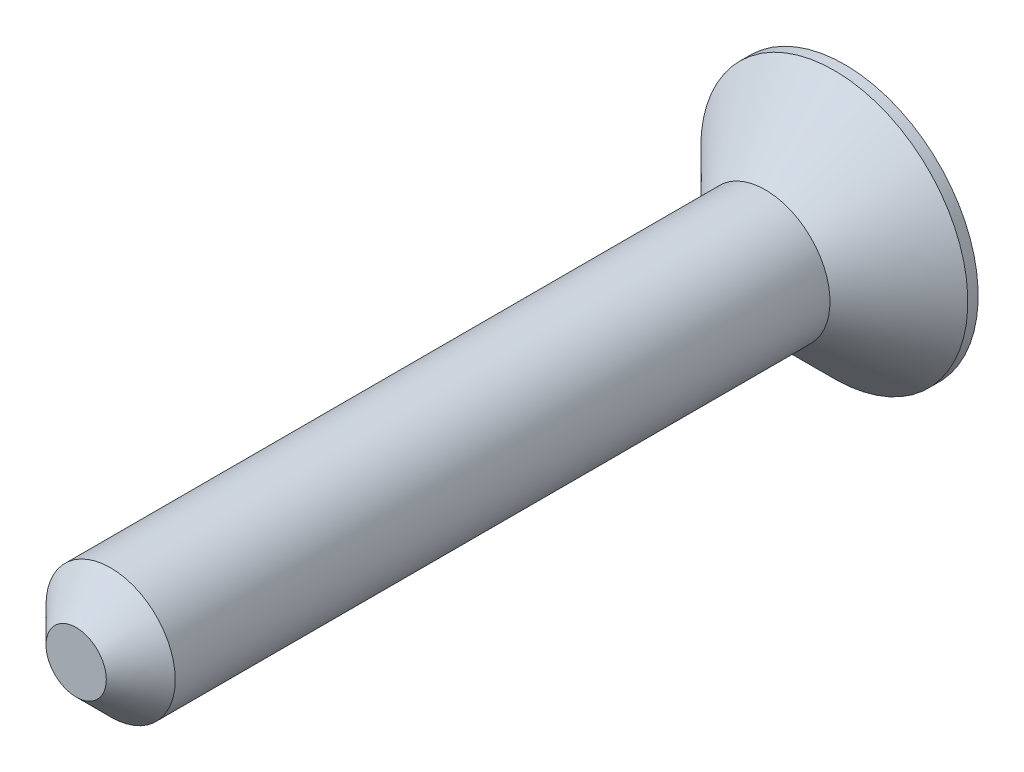
ISO-10303-21;
HEADER;
FILE_DESCRIPTION(('STEP AP214'),'2;1');
FILE_NAME('part.step','',(''),(''),'','','');
FILE_SCHEMA(('AUTOMOTIVE_DESIGN { 1 0 10303 214 1 1 1 1 }'));
ENDSEC;
DATA;
#1=APPLICATION_CONTEXT('core data for automotive mechanical design processes');
#2=APPLICATION_PROTOCOL_DEFINITION('international standard','automotive_design',2000,#1);
#3=PRODUCT_CONTEXT('',#1,'mechanical');
#4=PRODUCT('Part','Part','',(#3));
#5=PRODUCT_RELATED_PRODUCT_CATEGORY('part','',(#4));
#6=PRODUCT_DEFINITION_FORMATION('','',#4);
#7=PRODUCT_DEFINITION_CONTEXT('part definition',#1,'design');
#8=PRODUCT_DEFINITION('design','',#6,#7);
#9=PRODUCT_DEFINITION_SHAPE('','',#8);
#10=(LENGTH_UNIT() NAMED_UNIT(*) SI_UNIT(.MILLI.,.METRE.));
#11=(NAMED_UNIT(*) PLANE_ANGLE_UNIT() SI_UNIT($,.RADIAN.));
#12=(NAMED_UNIT(*) SI_UNIT($,.STERADIAN.) SOLID_ANGLE_UNIT());
#13=UNCERTAINTY_MEASURE_WITH_UNIT(LENGTH_MEASURE(1.E-05),#10,'distance_accuracy_value','');
#14=(GEOMETRIC_REPRESENTATION_CONTEXT(3) GLOBAL_UNCERTAINTY_ASSIGNED_CONTEXT((#13)) GLOBAL_UNIT_ASSIGNED_CONTEXT((#10,
#11,#12)) REPRESENTATION_CONTEXT('',''));
#15=CARTESIAN_POINT('',(0.,0.,0.));
#16=DIRECTION('',(0.,0.,1.));
#17=DIRECTION('',(1.,0.,0.));
#18=AXIS2_PLACEMENT_3D('',#15,#16,#17);
#19=CARTESIAN_POINT('',(0.,0.,50.8));
#20=DIRECTION('',(0.,0.,-1.));
#21=DIRECTION('',(-1.,0.,0.));
#22=AXIS2_PLACEMENT_3D('',#19,#20,#21);
#23=CYLINDRICAL_SURFACE('',#22,4.7625);
#24=CARTESIAN_POINT('',(0.,0.,48.26));
#25=DIRECTION('',(0.,0.,1.));
#26=DIRECTION('',(1.,0.,0.));
#27=AXIS2_PLACEMENT_3D('',#24,#25,#26);
#28=CIRCLE('',#27,4.7625);
#29=CARTESIAN_POINT('',(4.7625,0.,48.26));
#30=VERTEX_POINT('',#29);
#31=EDGE_CURVE('E11',#30,#30,#28,.F.);
#32=ORIENTED_EDGE('',*,*,#31,.T.);
#33=EDGE_LOOP('',(#32));
#34=FACE_BOUND('',#33,.T.);
#35=CARTESIAN_POINT('',(0.,0.,0.));
#36=DIRECTION('',(0.,0.,-1.));
#37=DIRECTION('',(-1.,0.,0.));
#38=AXIS2_PLACEMENT_3D('',#35,#36,#37);
#39=CIRCLE('',#38,4.7625);
#40=CARTESIAN_POINT('',(-4.7625,0.,0.));
#41=VERTEX_POINT('',#40);
#42=EDGE_CURVE('E227',#41,#41,#39,.T.);
#43=ORIENTED_EDGE('',*,*,#42,.F.);
#44=EDGE_LOOP('',(#43));
#45=FACE_BOUND('',#44,.T.);
#46=ADVANCED_FACE('F35',(#34,#45),#23,.T.);
#47=CARTESIAN_POINT('',(0.,0.,50.8));
#48=DIRECTION('',(0.,0.,1.));
#49=DIRECTION('',(1.,0.,0.));
#50=AXIS2_PLACEMENT_3D('',#47,#48,#49);
#51=PLANE('',#50);
#52=CARTESIAN_POINT('',(0.,0.,50.8));
#53=DIRECTION('',(0.,0.,1.));
#54=DIRECTION('',(1.,0.,0.));
#55=AXIS2_PLACEMENT_3D('',#52,#53,#54);
#56=CIRCLE('',#55,2.2225);
#57=CARTESIAN_POINT('',(2.2225,0.,50.8));
#58=VERTEX_POINT('',#57);
#59=EDGE_CURVE('E42',#58,#58,#56,.T.);
#60=ORIENTED_EDGE('',*,*,#59,.T.);
#61=EDGE_LOOP('',(#60));
#62=FACE_BOUND('',#61,.T.);
#63=ADVANCED_FACE('F236',(#62),#51,.T.);
#64=CARTESIAN_POINT('',(0.,0.,0.));
#65=DIRECTION('',(0.,0.,-1.));
#66=DIRECTION('',(-1.,0.,0.));
#67=AXIS2_PLACEMENT_3D('',#64,#65,#66);
#68=CONICAL_SURFACE('',#67,4.7625,0.78539816339745);
#69=CARTESIAN_POINT('',(0.,0.,-5.08));
#70=DIRECTION('',(0.,0.,-1.));
#71=DIRECTION('',(-1.,0.,0.));
#72=AXIS2_PLACEMENT_3D('',#69,#70,#71);
#73=CIRCLE('',#72,9.84250000000001);
#74=CARTESIAN_POINT('',(-9.84250000000001,0.,-5.08));
#75=VERTEX_POINT('',#74);
#76=EDGE_CURVE('E231',#75,#75,#73,.T.);
#77=ORIENTED_EDGE('',*,*,#76,.F.);
#78=EDGE_LOOP('',(#77));
#79=FACE_BOUND('',#78,.T.);
#80=ORIENTED_EDGE('',*,*,#42,.T.);
#81=EDGE_LOOP('',(#80));
#82=FACE_BOUND('',#81,.T.);
#83=ADVANCED_FACE('F257',(#79,#82),#68,.T.);
#84=CARTESIAN_POINT('',(0.,0.,-5.842));
#85=DIRECTION('',(0.,0.,-1.));
#86=DIRECTION('',(-1.,0.,0.));
#87=AXIS2_PLACEMENT_3D('',#84,#85,#86);
#88=PLANE('',#87);
#89=CARTESIAN_POINT('',(0.,0.,-5.842));
#90=DIRECTION('',(0.,0.,-1.));
#91=DIRECTION('',(-1.,0.,0.));
#92=AXIS2_PLACEMENT_3D('',#89,#90,#91);
#93=CIRCLE('',#92,9.84250000000001);
#94=CARTESIAN_POINT('',(-9.84250000000001,0.,-5.842));
#95=VERTEX_POINT('',#94);
#96=EDGE_CURVE('E180',#95,#95,#93,.T.);
#97=ORIENTED_EDGE('',*,*,#96,.T.);
#98=EDGE_LOOP('',(#97));
#99=FACE_BOUND('',#98,.T.);
#100=DIRECTION('',(-1.,0.,0.));
#101=VECTOR('',#100,1.);
#102=CARTESIAN_POINT('',(4.22585105403683,-0.877063426309507,-5.842));
#103=LINE('',#102,#101);
#104=CARTESIAN_POINT('',(4.22585105403683,-0.877063426309507,-5.842));
#105=VERTEX_POINT('',#104);
#106=CARTESIAN_POINT('',(0.877063426309509,-0.877063426309523,-5.842));
#107=VERTEX_POINT('',#106);
#108=EDGE_CURVE('E130',#105,#107,#103,.T.);
#109=ORIENTED_EDGE('',*,*,#108,.F.);
#110=DIRECTION('',(0.,-1.,0.));
#111=VECTOR('',#110,1.);
#112=CARTESIAN_POINT('',(4.22585105403684,0.877063426309477,-5.842));
#113=LINE('',#112,#111);
#114=CARTESIAN_POINT('',(4.22585105403684,0.877063426309477,-5.842));
#115=VERTEX_POINT('',#114);
#116=EDGE_CURVE('E141',#115,#105,#113,.T.);
#117=ORIENTED_EDGE('',*,*,#116,.F.);
#118=DIRECTION('',(1.,0.,0.));
#119=VECTOR('',#118,1.);
#120=CARTESIAN_POINT('',(0.877063426309519,0.877063426309512,-5.842));
#121=LINE('',#120,#119);
#122=CARTESIAN_POINT('',(0.877063426309519,0.877063426309512,-5.842));
#123=VERTEX_POINT('',#122);
#124=EDGE_CURVE('E178',#123,#115,#121,.T.);
#125=ORIENTED_EDGE('',*,*,#124,.F.);
#126=DIRECTION('',(0.,-1.,0.));
#127=VECTOR('',#126,1.);
#128=CARTESIAN_POINT('',(0.877063426309492,4.22585105403684,-5.842));
#129=LINE('',#128,#127);
#130=CARTESIAN_POINT('',(0.877063426309492,4.22585105403684,-5.842));
#131=VERTEX_POINT('',#130);
#132=EDGE_CURVE('E175',#131,#123,#129,.T.);
#133=ORIENTED_EDGE('',*,*,#132,.F.);
#134=DIRECTION('',(1.,0.,0.));
#135=VECTOR('',#134,1.);
#136=CARTESIAN_POINT('',(-0.877063426309492,4.22585105403684,-5.842));
#137=LINE('',#136,#135);
#138=CARTESIAN_POINT('',(-0.877063426309492,4.22585105403684,-5.842));
#139=VERTEX_POINT('',#138);
#140=EDGE_CURVE('E173',#139,#131,#137,.T.);
#141=ORIENTED_EDGE('',*,*,#140,.F.);
#142=DIRECTION('',(0.,1.,0.));
#143=VECTOR('',#142,1.);
#144=CARTESIAN_POINT('',(-0.877063426309519,0.877063426309535,-5.842));
#145=LINE('',#144,#143);
#146=CARTESIAN_POINT('',(-0.877063426309519,0.877063426309535,-5.842));
#147=VERTEX_POINT('',#146);
#148=EDGE_CURVE('E170',#147,#139,#145,.T.);
#149=ORIENTED_EDGE('',*,*,#148,.F.);
#150=DIRECTION('',(1.,0.,0.));
#151=VECTOR('',#150,1.);
#152=CARTESIAN_POINT('',(-4.22585105403683,0.877063426309536,-5.842));
#153=LINE('',#152,#151);
#154=CARTESIAN_POINT('',(-4.22585105403683,0.877063426309536,-5.842));
#155=VERTEX_POINT('',#154);
#156=EDGE_CURVE('E167',#155,#147,#153,.T.);
#157=ORIENTED_EDGE('',*,*,#156,.F.);
#158=DIRECTION('',(0.,1.,0.));
#159=VECTOR('',#158,1.);
#160=CARTESIAN_POINT('',(-4.22585105403685,-0.877063426309448,-5.842));
#161=LINE('',#160,#159);
#162=CARTESIAN_POINT('',(-4.22585105403685,-0.877063426309448,-5.842));
#163=VERTEX_POINT('',#162);
#164=EDGE_CURVE('E164',#163,#155,#161,.T.);
#165=ORIENTED_EDGE('',*,*,#164,.F.);
#166=DIRECTION('',(-1.,0.,0.));
#167=VECTOR('',#166,1.);
#168=CARTESIAN_POINT('',(-0.877063426309523,-0.877063426309506,-5.842));
#169=LINE('',#168,#167);
#170=CARTESIAN_POINT('',(-0.877063426309523,-0.877063426309506,-5.842));
#171=VERTEX_POINT('',#170);
#172=EDGE_CURVE('E161',#171,#163,#169,.T.);
#173=ORIENTED_EDGE('',*,*,#172,.F.);
#174=DIRECTION('',(0.,1.,0.));
#175=VECTOR('',#174,1.);
#176=CARTESIAN_POINT('',(-0.877063426309521,-4.22585105403683,-5.842));
#177=LINE('',#176,#175);
#178=CARTESIAN_POINT('',(-0.877063426309521,-4.22585105403683,-5.842));
#179=VERTEX_POINT('',#178);
#180=EDGE_CURVE('E158',#179,#171,#177,.T.);
#181=ORIENTED_EDGE('',*,*,#180,.F.);
#182=DIRECTION('',(-1.,0.,0.));
#183=VECTOR('',#182,1.);
#184=CARTESIAN_POINT('',(0.877063426309463,-4.22585105403684,-5.842));
#185=LINE('',#184,#183);
#186=CARTESIAN_POINT('',(0.877063426309463,-4.22585105403684,-5.842));
#187=VERTEX_POINT('',#186);
#188=EDGE_CURVE('E153',#187,#179,#185,.T.);
#189=ORIENTED_EDGE('',*,*,#188,.F.);
#190=DIRECTION('',(0.,-1.,0.));
#191=VECTOR('',#190,1.);
#192=CARTESIAN_POINT('',(0.877063426309509,-0.877063426309523,-5.842));
#193=LINE('',#192,#191);
#194=EDGE_CURVE('E151',#107,#187,#193,.T.);
#195=ORIENTED_EDGE('',*,*,#194,.F.);
#196=EDGE_LOOP('',(#109,#117,#125,#133,#141,#149,#157,#165,#173,#181,#189,#195));
#197=FACE_BOUND('',#196,.T.);
#198=ADVANCED_FACE('F148',(#99,#197),#88,.T.);
#199=CARTESIAN_POINT('',(0.,0.,-5.842));
#200=DIRECTION('',(0.,0.,1.));
#201=DIRECTION('',(1.,0.,0.));
#202=AXIS2_PLACEMENT_3D('',#199,#200,#201);
#203=CYLINDRICAL_SURFACE('',#202,9.84250000000001);
#204=ORIENTED_EDGE('',*,*,#96,.F.);
#205=EDGE_LOOP('',(#204));
#206=FACE_BOUND('',#205,.T.);
#207=ORIENTED_EDGE('',*,*,#76,.T.);
#208=EDGE_LOOP('',(#207));
#209=FACE_BOUND('',#208,.T.);
#210=ADVANCED_FACE('F267',(#206,#209),#203,.T.);
#211=CARTESIAN_POINT('',(-0.877063426309492,4.22585105403684,-1.905));
#212=DIRECTION('',(0.,0.,1.));
#213=DIRECTION('',(1.,0.,0.));
#214=AXIS2_PLACEMENT_3D('',#211,#212,#213);
#215=PLANE('',#214);
#216=DIRECTION('',(1.,0.,0.));
#217=VECTOR('',#216,1.);
#218=CARTESIAN_POINT('',(4.22585105403684,0.877063426309477,-1.905));
#219=LINE('',#218,#217);
#220=CARTESIAN_POINT('',(-4.22585105403683,0.877063426309536,-1.905));
#221=VERTEX_POINT('',#220);
#222=CARTESIAN_POINT('',(-0.877063426309523,0.877063426309533,-1.905));
#223=VERTEX_POINT('',#222);
#224=EDGE_CURVE('E138',#221,#223,#219,.T.);
#225=ORIENTED_EDGE('',*,*,#224,.T.);
#226=DIRECTION('',(0.,1.,0.));
#227=VECTOR('',#226,1.);
#228=CARTESIAN_POINT('',(-0.877063426309492,4.22585105403684,-1.905));
#229=LINE('',#228,#227);
#230=CARTESIAN_POINT('',(-0.877063426309492,4.22585105403684,-1.905));
#231=VERTEX_POINT('',#230);
#232=EDGE_CURVE('E49',#223,#231,#229,.T.);
#233=ORIENTED_EDGE('',*,*,#232,.T.);
#234=DIRECTION('',(1.,0.,0.));
#235=VECTOR('',#234,1.);
#236=CARTESIAN_POINT('',(0.877063426309492,4.22585105403684,-1.905));
#237=LINE('',#236,#235);
#238=CARTESIAN_POINT('',(0.877063426309492,4.22585105403684,-1.905));
#239=VERTEX_POINT('',#238);
#240=EDGE_CURVE('E219',#231,#239,#237,.T.);
#241=ORIENTED_EDGE('',*,*,#240,.T.);
#242=DIRECTION('',(0.,-1.,0.));
#243=VECTOR('',#242,1.);
#244=CARTESIAN_POINT('',(0.877063426309492,4.22585105403684,-1.905));
#245=LINE('',#244,#243);
#246=CARTESIAN_POINT('',(0.877063426309523,0.877063426309514,-1.905));
#247=VERTEX_POINT('',#246);
#248=EDGE_CURVE('E221',#239,#247,#245,.T.);
#249=ORIENTED_EDGE('',*,*,#248,.T.);
#250=CARTESIAN_POINT('',(4.22585105403684,0.877063426309477,-1.905));
#251=VERTEX_POINT('',#250);
#252=EDGE_CURVE('E211',#247,#251,#219,.T.);
#253=ORIENTED_EDGE('',*,*,#252,.T.);
#254=DIRECTION('',(0.,-1.,0.));
#255=VECTOR('',#254,1.);
#256=CARTESIAN_POINT('',(4.22585105403683,-0.877063426309507,-1.905));
#257=LINE('',#256,#255);
#258=CARTESIAN_POINT('',(4.22585105403683,-0.877063426309507,-1.905));
#259=VERTEX_POINT('',#258);
#260=EDGE_CURVE('E208',#251,#259,#257,.T.);
#261=ORIENTED_EDGE('',*,*,#260,.T.);
#262=DIRECTION('',(-1.,0.,0.));
#263=VECTOR('',#262,1.);
#264=CARTESIAN_POINT('',(4.22585105403683,-0.877063426309507,-1.905));
#265=LINE('',#264,#263);
#266=CARTESIAN_POINT('',(0.877063426309511,-0.877063426309523,-1.905));
#267=VERTEX_POINT('',#266);
#268=EDGE_CURVE('E133',#259,#267,#265,.T.);
#269=ORIENTED_EDGE('',*,*,#268,.T.);
#270=DIRECTION('',(0.,-1.,0.));
#271=VECTOR('',#270,1.);
#272=CARTESIAN_POINT('',(0.877063426309463,-4.22585105403684,-1.905));
#273=LINE('',#272,#271);
#274=CARTESIAN_POINT('',(0.877063426309463,-4.22585105403684,-1.905));
#275=VERTEX_POINT('',#274);
#276=EDGE_CURVE('E200',#267,#275,#273,.T.);
#277=ORIENTED_EDGE('',*,*,#276,.T.);
#278=DIRECTION('',(-1.,0.,0.));
#279=VECTOR('',#278,1.);
#280=CARTESIAN_POINT('',(-0.877063426309521,-4.22585105403683,-1.905));
#281=LINE('',#280,#279);
#282=CARTESIAN_POINT('',(-0.877063426309521,-4.22585105403683,-1.905));
#283=VERTEX_POINT('',#282);
#284=EDGE_CURVE('E194',#275,#283,#281,.T.);
#285=ORIENTED_EDGE('',*,*,#284,.T.);
#286=DIRECTION('',(0.,1.,0.));
#287=VECTOR('',#286,1.);
#288=CARTESIAN_POINT('',(-0.877063426309521,-4.22585105403683,-1.905));
#289=LINE('',#288,#287);
#290=CARTESIAN_POINT('',(-0.877063426309523,-0.877063426309508,-1.905));
#291=VERTEX_POINT('',#290);
#292=EDGE_CURVE('E197',#283,#291,#289,.T.);
#293=ORIENTED_EDGE('',*,*,#292,.T.);
#294=DIRECTION('',(-1.,0.,0.));
#295=VECTOR('',#294,1.);
#296=CARTESIAN_POINT('',(-4.22585105403685,-0.877063426309448,-1.905));
#297=LINE('',#296,#295);
#298=CARTESIAN_POINT('',(-4.22585105403685,-0.877063426309448,-1.905));
#299=VERTEX_POINT('',#298);
#300=EDGE_CURVE('E186',#291,#299,#297,.T.);
#301=ORIENTED_EDGE('',*,*,#300,.T.);
#302=DIRECTION('',(0.,1.,0.));
#303=VECTOR('',#302,1.);
#304=CARTESIAN_POINT('',(-4.22585105403683,0.877063426309536,-1.905));
#305=LINE('',#304,#303);
#306=EDGE_CURVE('E183',#299,#221,#305,.T.);
#307=ORIENTED_EDGE('',*,*,#306,.T.);
#308=EDGE_LOOP('',(#225,#233,#241,#249,#253,#261,#269,#277,#285,#293,#301,#307));
#309=FACE_BOUND('',#308,.T.);
#310=ADVANCED_FACE('F281',(#309),#215,.F.);
#311=CARTESIAN_POINT('',(4.22585105403683,-0.877063426309507,-1.905));
#312=DIRECTION('',(1.,0.,0.));
#313=DIRECTION('',(0.,1.,0.));
#314=AXIS2_PLACEMENT_3D('',#311,#312,#313);
#315=PLANE('',#314);
#316=DIRECTION('',(0.,0.,-1.));
#317=VECTOR('',#316,1.);
#318=CARTESIAN_POINT('',(4.22585105403684,0.877063426309477,-1.905));
#319=LINE('',#318,#317);
#320=EDGE_CURVE('E137',#251,#115,#319,.T.);
#321=ORIENTED_EDGE('',*,*,#320,.T.);
#322=ORIENTED_EDGE('',*,*,#116,.T.);
#323=DIRECTION('',(0.,0.,-1.));
#324=VECTOR('',#323,1.);
#325=CARTESIAN_POINT('',(4.22585105403683,-0.877063426309507,-1.905));
#326=LINE('',#325,#324);
#327=EDGE_CURVE('E126',#259,#105,#326,.T.);
#328=ORIENTED_EDGE('',*,*,#327,.F.);
#329=ORIENTED_EDGE('',*,*,#260,.F.);
#330=EDGE_LOOP('',(#321,#322,#328,#329));
#331=FACE_BOUND('',#330,.T.);
#332=ADVANCED_FACE('F142',(#331),#315,.F.);
#333=CARTESIAN_POINT('',(4.22585105403683,-0.877063426309507,-1.905));
#334=DIRECTION('',(0.,-1.,0.));
#335=DIRECTION('',(1.,0.,0.));
#336=AXIS2_PLACEMENT_3D('',#333,#334,#335);
#337=PLANE('',#336);
#338=DIRECTION('',(0.,0.,1.));
#339=VECTOR('',#338,1.);
#340=CARTESIAN_POINT('',(0.877063426309511,-0.87706342630952,-1.905));
#341=LINE('',#340,#339);
#342=EDGE_CURVE('E205',#107,#267,#341,.T.);
#343=ORIENTED_EDGE('',*,*,#342,.T.);
#344=ORIENTED_EDGE('',*,*,#268,.F.);
#345=ORIENTED_EDGE('',*,*,#327,.T.);
#346=ORIENTED_EDGE('',*,*,#108,.T.);
#347=EDGE_LOOP('',(#343,#344,#345,#346));
#348=FACE_BOUND('',#347,.T.);
#349=ADVANCED_FACE('F128',(#348),#337,.F.);
#350=CARTESIAN_POINT('',(0.877063426309463,-4.22585105403684,-1.905));
#351=DIRECTION('',(1.,0.,0.));
#352=DIRECTION('',(0.,1.,0.));
#353=AXIS2_PLACEMENT_3D('',#350,#351,#352);
#354=PLANE('',#353);
#355=ORIENTED_EDGE('',*,*,#342,.F.);
#356=ORIENTED_EDGE('',*,*,#194,.T.);
#357=DIRECTION('',(0.,0.,-1.));
#358=VECTOR('',#357,1.);
#359=CARTESIAN_POINT('',(0.877063426309463,-4.22585105403684,-1.905));
#360=LINE('',#359,#358);
#361=EDGE_CURVE('E203',#275,#187,#360,.T.);
#362=ORIENTED_EDGE('',*,*,#361,.F.);
#363=ORIENTED_EDGE('',*,*,#276,.F.);
#364=EDGE_LOOP('',(#355,#356,#362,#363));
#365=FACE_BOUND('',#364,.T.);
#366=ADVANCED_FACE('F287',(#365),#354,.F.);
#367=CARTESIAN_POINT('',(-0.877063426309521,-4.22585105403683,-1.905));
#368=DIRECTION('',(0.,-1.,0.));
#369=DIRECTION('',(1.,0.,0.));
#370=AXIS2_PLACEMENT_3D('',#367,#368,#369);
#371=PLANE('',#370);
#372=ORIENTED_EDGE('',*,*,#361,.T.);
#373=ORIENTED_EDGE('',*,*,#188,.T.);
#374=DIRECTION('',(0.,0.,-1.));
#375=VECTOR('',#374,1.);
#376=CARTESIAN_POINT('',(-0.877063426309521,-4.22585105403683,-1.905));
#377=LINE('',#376,#375);
#378=EDGE_CURVE('E202',#283,#179,#377,.T.);
#379=ORIENTED_EDGE('',*,*,#378,.F.);
#380=ORIENTED_EDGE('',*,*,#284,.F.);
#381=EDGE_LOOP('',(#372,#373,#379,#380));
#382=FACE_BOUND('',#381,.T.);
#383=ADVANCED_FACE('F292',(#382),#371,.F.);
#384=CARTESIAN_POINT('',(-0.877063426309521,-4.22585105403683,-1.905));
#385=DIRECTION('',(-1.,0.,0.));
#386=DIRECTION('',(0.,-1.,0.));
#387=AXIS2_PLACEMENT_3D('',#384,#385,#386);
#388=PLANE('',#387);
#389=DIRECTION('',(0.,0.,1.));
#390=VECTOR('',#389,1.);
#391=CARTESIAN_POINT('',(-0.877063426309523,-0.877063426309508,-1.905));
#392=LINE('',#391,#390);
#393=EDGE_CURVE('E191',#171,#291,#392,.T.);
#394=ORIENTED_EDGE('',*,*,#393,.T.);
#395=ORIENTED_EDGE('',*,*,#292,.F.);
#396=ORIENTED_EDGE('',*,*,#378,.T.);
#397=ORIENTED_EDGE('',*,*,#180,.T.);
#398=EDGE_LOOP('',(#394,#395,#396,#397));
#399=FACE_BOUND('',#398,.T.);
#400=ADVANCED_FACE('F295',(#399),#388,.F.);
#401=CARTESIAN_POINT('',(-4.22585105403685,-0.877063426309448,-1.905));
#402=DIRECTION('',(0.,-1.,0.));
#403=DIRECTION('',(1.,0.,0.));
#404=AXIS2_PLACEMENT_3D('',#401,#402,#403);
#405=PLANE('',#404);
#406=ORIENTED_EDGE('',*,*,#393,.F.);
#407=ORIENTED_EDGE('',*,*,#172,.T.);
#408=DIRECTION('',(0.,0.,-1.));
#409=VECTOR('',#408,1.);
#410=CARTESIAN_POINT('',(-4.22585105403685,-0.877063426309448,-1.905));
#411=LINE('',#410,#409);
#412=EDGE_CURVE('E189',#299,#163,#411,.T.);
#413=ORIENTED_EDGE('',*,*,#412,.F.);
#414=ORIENTED_EDGE('',*,*,#300,.F.);
#415=EDGE_LOOP('',(#406,#407,#413,#414));
#416=FACE_BOUND('',#415,.T.);
#417=ADVANCED_FACE('F299',(#416),#405,.F.);
#418=CARTESIAN_POINT('',(-4.22585105403683,0.877063426309536,-1.905));
#419=DIRECTION('',(-1.,0.,0.));
#420=DIRECTION('',(0.,-1.,0.));
#421=AXIS2_PLACEMENT_3D('',#418,#419,#420);
#422=PLANE('',#421);
#423=ORIENTED_EDGE('',*,*,#412,.T.);
#424=ORIENTED_EDGE('',*,*,#164,.T.);
#425=DIRECTION('',(0.,0.,-1.));
#426=VECTOR('',#425,1.);
#427=CARTESIAN_POINT('',(-4.22585105403683,0.877063426309536,-1.905));
#428=LINE('',#427,#426);
#429=EDGE_CURVE('E188',#221,#155,#428,.T.);
#430=ORIENTED_EDGE('',*,*,#429,.F.);
#431=ORIENTED_EDGE('',*,*,#306,.F.);
#432=EDGE_LOOP('',(#423,#424,#430,#431));
#433=FACE_BOUND('',#432,.T.);
#434=ADVANCED_FACE('F290',(#433),#422,.F.);
#435=CARTESIAN_POINT('',(4.22585105403684,0.877063426309477,-1.905));
#436=DIRECTION('',(0.,1.,0.));
#437=DIRECTION('',(-1.,0.,0.));
#438=AXIS2_PLACEMENT_3D('',#435,#436,#437);
#439=PLANE('',#438);
#440=ORIENTED_EDGE('',*,*,#224,.F.);
#441=ORIENTED_EDGE('',*,*,#429,.T.);
#442=ORIENTED_EDGE('',*,*,#156,.T.);
#443=DIRECTION('',(0.,0.,-1.));
#444=VECTOR('',#443,1.);
#445=CARTESIAN_POINT('',(-0.877063426309517,0.877063426309533,-1.905));
#446=LINE('',#445,#444);
#447=EDGE_CURVE('E217',#223,#147,#446,.T.);
#448=ORIENTED_EDGE('',*,*,#447,.F.);
#449=EDGE_LOOP('',(#440,#441,#442,#448));
#450=FACE_BOUND('',#449,.T.);
#451=ADVANCED_FACE('F249',(#450),#439,.F.);
#452=CARTESIAN_POINT('',(-0.877063426309492,4.22585105403684,-1.905));
#453=DIRECTION('',(-1.,0.,0.));
#454=DIRECTION('',(0.,-1.,0.));
#455=AXIS2_PLACEMENT_3D('',#452,#453,#454);
#456=PLANE('',#455);
#457=ORIENTED_EDGE('',*,*,#232,.F.);
#458=ORIENTED_EDGE('',*,*,#447,.T.);
#459=ORIENTED_EDGE('',*,*,#148,.T.);
#460=DIRECTION('',(0.,0.,-1.));
#461=VECTOR('',#460,1.);
#462=CARTESIAN_POINT('',(-0.877063426309492,4.22585105403684,-1.905));
#463=LINE('',#462,#461);
#464=EDGE_CURVE('E225',#231,#139,#463,.T.);
#465=ORIENTED_EDGE('',*,*,#464,.F.);
#466=EDGE_LOOP('',(#457,#458,#459,#465));
#467=FACE_BOUND('',#466,.T.);
#468=ADVANCED_FACE('F274',(#467),#456,.F.);
#469=CARTESIAN_POINT('',(0.877063426309492,4.22585105403684,-1.905));
#470=DIRECTION('',(0.,1.,0.));
#471=DIRECTION('',(0.,0.,1.));
#472=AXIS2_PLACEMENT_3D('',#469,#470,#471);
#473=PLANE('',#472);
#474=ORIENTED_EDGE('',*,*,#464,.T.);
#475=ORIENTED_EDGE('',*,*,#140,.T.);
#476=DIRECTION('',(0.,0.,-1.));
#477=VECTOR('',#476,1.);
#478=CARTESIAN_POINT('',(0.877063426309492,4.22585105403684,-1.905));
#479=LINE('',#478,#477);
#480=EDGE_CURVE('E57',#239,#131,#479,.T.);
#481=ORIENTED_EDGE('',*,*,#480,.F.);
#482=ORIENTED_EDGE('',*,*,#240,.F.);
#483=EDGE_LOOP('',(#474,#475,#481,#482));
#484=FACE_BOUND('',#483,.T.);
#485=ADVANCED_FACE('F271',(#484),#473,.F.);
#486=CARTESIAN_POINT('',(0.877063426309492,4.22585105403684,-1.905));
#487=DIRECTION('',(1.,0.,0.));
#488=DIRECTION('',(0.,1.,0.));
#489=AXIS2_PLACEMENT_3D('',#486,#487,#488);
#490=PLANE('',#489);
#491=ORIENTED_EDGE('',*,*,#480,.T.);
#492=ORIENTED_EDGE('',*,*,#132,.T.);
#493=DIRECTION('',(0.,0.,1.));
#494=VECTOR('',#493,1.);
#495=CARTESIAN_POINT('',(0.877063426309517,0.877063426309514,-1.905));
#496=LINE('',#495,#494);
#497=EDGE_CURVE('E213',#123,#247,#496,.T.);
#498=ORIENTED_EDGE('',*,*,#497,.T.);
#499=ORIENTED_EDGE('',*,*,#248,.F.);
#500=EDGE_LOOP('',(#491,#492,#498,#499));
#501=FACE_BOUND('',#500,.T.);
#502=ADVANCED_FACE('F246',(#501),#490,.F.);
#503=ORIENTED_EDGE('',*,*,#497,.F.);
#504=ORIENTED_EDGE('',*,*,#124,.T.);
#505=ORIENTED_EDGE('',*,*,#320,.F.);
#506=ORIENTED_EDGE('',*,*,#252,.F.);
#507=EDGE_LOOP('',(#503,#504,#505,#506));
#508=FACE_BOUND('',#507,.T.);
#509=ADVANCED_FACE('F240',(#508),#439,.F.);
#510=CARTESIAN_POINT('',(0.,0.,50.8));
#511=DIRECTION('',(0.,0.,-1.));
#512=DIRECTION('',(-1.,0.,0.));
#513=AXIS2_PLACEMENT_3D('',#510,#511,#512);
#514=CONICAL_SURFACE('',#513,2.2225,0.785398163397446);
#515=ORIENTED_EDGE('',*,*,#31,.F.);
#516=EDGE_LOOP('',(#515));
#517=FACE_BOUND('',#516,.T.);
#518=ORIENTED_EDGE('',*,*,#59,.F.);
#519=EDGE_LOOP('',(#518));
#520=FACE_BOUND('',#519,.T.);
#521=ADVANCED_FACE('F238',(#517,#520),#514,.T.);
#522=CLOSED_SHELL('',(#46,#63,#83,#198,#210,#310,#332,#349,#366,#383,#400,#417,#434,#451,#468,
#485,#502,#509,#521));
#523=MANIFOLD_SOLID_BREP('B2',#522);
#524=ADVANCED_BREP_SHAPE_REPRESENTATION('',(#18,#523),#14);
#525=SHAPE_DEFINITION_REPRESENTATION(#9,#524);
ENDSEC;
END-ISO-10303-21;
